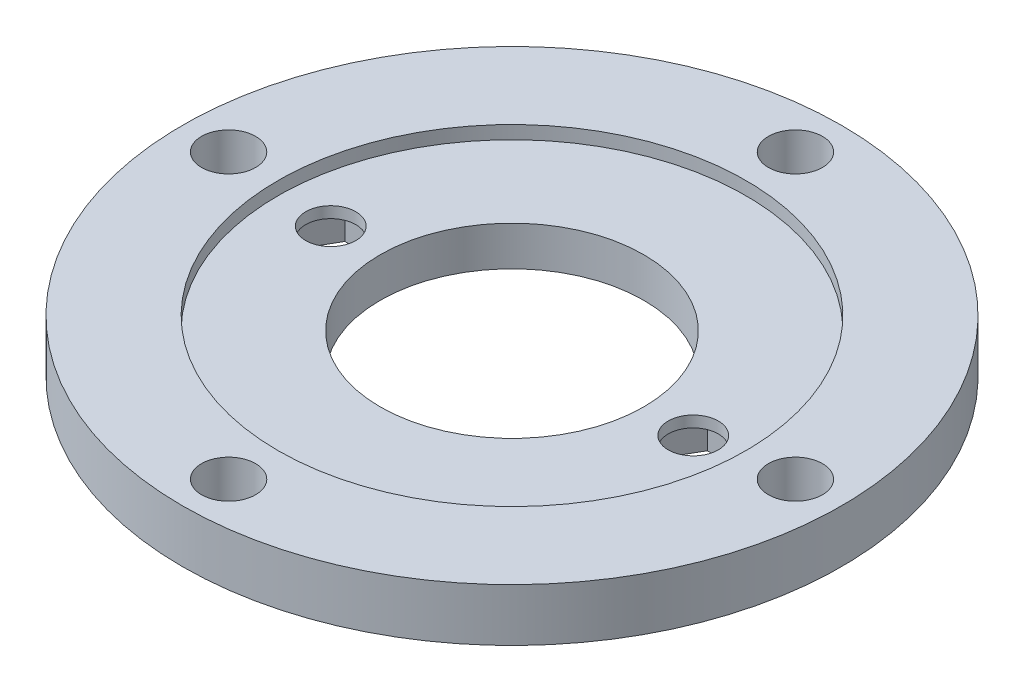
ISO-10303-21;
HEADER;
FILE_DESCRIPTION(('STEP AP214'),'2;1');
FILE_NAME('part.step','',(''),(''),'','','');
FILE_SCHEMA(('AUTOMOTIVE_DESIGN { 1 0 10303 214 1 1 1 1 }'));
ENDSEC;
DATA;
#1=APPLICATION_CONTEXT('core data for automotive mechanical design processes');
#2=APPLICATION_PROTOCOL_DEFINITION('international standard','automotive_design',2000,#1);
#3=PRODUCT_CONTEXT('',#1,'mechanical');
#4=PRODUCT('Part','Part','',(#3));
#5=PRODUCT_RELATED_PRODUCT_CATEGORY('part','',(#4));
#6=PRODUCT_DEFINITION_FORMATION('','',#4);
#7=PRODUCT_DEFINITION_CONTEXT('part definition',#1,'design');
#8=PRODUCT_DEFINITION('design','',#6,#7);
#9=PRODUCT_DEFINITION_SHAPE('','',#8);
#10=(LENGTH_UNIT() NAMED_UNIT(*) SI_UNIT(.MILLI.,.METRE.));
#11=(NAMED_UNIT(*) PLANE_ANGLE_UNIT() SI_UNIT($,.RADIAN.));
#12=(NAMED_UNIT(*) SI_UNIT($,.STERADIAN.) SOLID_ANGLE_UNIT());
#13=UNCERTAINTY_MEASURE_WITH_UNIT(LENGTH_MEASURE(1.E-05),#10,'distance_accuracy_value','');
#14=(GEOMETRIC_REPRESENTATION_CONTEXT(3) GLOBAL_UNCERTAINTY_ASSIGNED_CONTEXT((#13)) GLOBAL_UNIT_ASSIGNED_CONTEXT((#10,
#11,#12)) REPRESENTATION_CONTEXT('',''));
#15=CARTESIAN_POINT('',(0.,0.,0.));
#16=DIRECTION('',(0.,0.,1.));
#17=DIRECTION('',(1.,0.,0.));
#18=AXIS2_PLACEMENT_3D('',#15,#16,#17);
#19=CARTESIAN_POINT('',(0.,0.,0.));
#20=DIRECTION('',(0.,1.,0.));
#21=DIRECTION('',(0.,0.,1.));
#22=AXIS2_PLACEMENT_3D('',#19,#20,#21);
#23=PLANE('',#22);
#24=DIRECTION('',(0.499999999999999,0.,-0.866025403784439));
#25=VECTOR('',#24,1.);
#26=CARTESIAN_POINT('',(-16.2515717108886,0.,-9.38284930203602));
#27=LINE('',#26,#25);
#28=CARTESIAN_POINT('',(-24.5843811405924,0.,5.05));
#29=VERTEX_POINT('',#28);
#30=CARTESIAN_POINT('',(-21.6687622811848,0.,0.));
#31=VERTEX_POINT('',#30);
#32=EDGE_CURVE('E58',#29,#31,#27,.T.);
#33=ORIENTED_EDGE('',*,*,#32,.T.);
#34=DIRECTION('',(-0.5,0.,-0.866025403784439));
#35=VECTOR('',#34,1.);
#36=CARTESIAN_POINT('',(-16.2515717108886,0.,9.38284930203603));
#37=LINE('',#36,#35);
#38=CARTESIAN_POINT('',(-24.5843811405924,0.,-5.05));
#39=VERTEX_POINT('',#38);
#40=EDGE_CURVE('E149',#31,#39,#37,.T.);
#41=ORIENTED_EDGE('',*,*,#40,.T.);
#42=DIRECTION('',(-1.,0.,0.));
#43=VECTOR('',#42,1.);
#44=CARTESIAN_POINT('',(0.,0.,-5.05));
#45=LINE('',#44,#43);
#46=CARTESIAN_POINT('',(-30.4156188594076,0.,-5.05));
#47=VERTEX_POINT('',#46);
#48=EDGE_CURVE('E172',#39,#47,#45,.T.);
#49=ORIENTED_EDGE('',*,*,#48,.T.);
#50=DIRECTION('',(-0.5,0.,0.866025403784439));
#51=VECTOR('',#50,1.);
#52=CARTESIAN_POINT('',(-24.9984282891114,0.,-14.432849302036));
#53=LINE('',#52,#51);
#54=CARTESIAN_POINT('',(-33.3312377188152,0.,0.));
#55=VERTEX_POINT('',#54);
#56=EDGE_CURVE('E175',#47,#55,#53,.T.);
#57=ORIENTED_EDGE('',*,*,#56,.T.);
#58=DIRECTION('',(0.5,0.,0.866025403784439));
#59=VECTOR('',#58,1.);
#60=CARTESIAN_POINT('',(-24.9984282891114,0.,14.432849302036));
#61=LINE('',#60,#59);
#62=CARTESIAN_POINT('',(-30.4156188594076,0.,5.05));
#63=VERTEX_POINT('',#62);
#64=EDGE_CURVE('E178',#55,#63,#61,.T.);
#65=ORIENTED_EDGE('',*,*,#64,.T.);
#66=DIRECTION('',(1.,0.,0.));
#67=VECTOR('',#66,1.);
#68=CARTESIAN_POINT('',(0.,0.,5.05000000000001));
#69=LINE('',#68,#67);
#70=EDGE_CURVE('E159',#63,#29,#69,.T.);
#71=ORIENTED_EDGE('',*,*,#70,.T.);
#72=EDGE_LOOP('',(#33,#41,#49,#57,#65,#71));
#73=FACE_BOUND('',#72,.T.);
#74=CARTESIAN_POINT('',(-43.,0.,0.));
#75=DIRECTION('',(0.,1.,0.));
#76=DIRECTION('',(0.,0.,1.));
#77=AXIS2_PLACEMENT_3D('',#74,#75,#76);
#78=CIRCLE('',#77,4.1);
#79=CARTESIAN_POINT('',(-43.,0.,4.1));
#80=VERTEX_POINT('',#79);
#81=EDGE_CURVE('E201',#80,#80,#78,.T.);
#82=ORIENTED_EDGE('',*,*,#81,.T.);
#83=EDGE_LOOP('',(#82));
#84=FACE_BOUND('',#83,.T.);
#85=CARTESIAN_POINT('',(0.,0.,-43.));
#86=DIRECTION('',(0.,1.,0.));
#87=DIRECTION('',(0.,0.,1.));
#88=AXIS2_PLACEMENT_3D('',#85,#86,#87);
#89=CIRCLE('',#88,4.1);
#90=CARTESIAN_POINT('',(0.,0.,-38.9));
#91=VERTEX_POINT('',#90);
#92=EDGE_CURVE('E205',#91,#91,#89,.T.);
#93=ORIENTED_EDGE('',*,*,#92,.T.);
#94=EDGE_LOOP('',(#93));
#95=FACE_BOUND('',#94,.T.);
#96=CARTESIAN_POINT('',(43.,0.,0.));
#97=DIRECTION('',(0.,1.,0.));
#98=DIRECTION('',(0.,0.,1.));
#99=AXIS2_PLACEMENT_3D('',#96,#97,#98);
#100=CIRCLE('',#99,4.1);
#101=CARTESIAN_POINT('',(43.,0.,4.1));
#102=VERTEX_POINT('',#101);
#103=EDGE_CURVE('E198',#102,#102,#100,.T.);
#104=ORIENTED_EDGE('',*,*,#103,.T.);
#105=EDGE_LOOP('',(#104));
#106=FACE_BOUND('',#105,.T.);
#107=CARTESIAN_POINT('',(0.,0.,43.));
#108=DIRECTION('',(0.,1.,0.));
#109=DIRECTION('',(0.,0.,1.));
#110=AXIS2_PLACEMENT_3D('',#107,#108,#109);
#111=CIRCLE('',#110,4.1);
#112=CARTESIAN_POINT('',(0.,0.,47.1));
#113=VERTEX_POINT('',#112);
#114=EDGE_CURVE('E218',#113,#113,#111,.T.);
#115=ORIENTED_EDGE('',*,*,#114,.T.);
#116=EDGE_LOOP('',(#115));
#117=FACE_BOUND('',#116,.T.);
#118=CARTESIAN_POINT('',(0.,0.,0.));
#119=DIRECTION('',(0.,1.,0.));
#120=DIRECTION('',(0.,0.,1.));
#121=AXIS2_PLACEMENT_3D('',#118,#119,#120);
#122=CIRCLE('',#121,50.);
#123=CARTESIAN_POINT('',(0.,0.,50.));
#124=VERTEX_POINT('',#123);
#125=EDGE_CURVE('E227',#124,#124,#122,.T.);
#126=ORIENTED_EDGE('',*,*,#125,.F.);
#127=EDGE_LOOP('',(#126));
#128=FACE_BOUND('',#127,.T.);
#129=CARTESIAN_POINT('',(0.,0.,0.));
#130=DIRECTION('',(0.,1.,0.));
#131=DIRECTION('',(0.,0.,1.));
#132=AXIS2_PLACEMENT_3D('',#129,#130,#131);
#133=CIRCLE('',#132,20.);
#134=CARTESIAN_POINT('',(0.,0.,20.));
#135=VERTEX_POINT('',#134);
#136=EDGE_CURVE('E194',#135,#135,#133,.T.);
#137=ORIENTED_EDGE('',*,*,#136,.T.);
#138=EDGE_LOOP('',(#137));
#139=FACE_BOUND('',#138,.T.);
#140=DIRECTION('',(0.499999999999999,0.,-0.866025403784439));
#141=VECTOR('',#140,1.);
#142=CARTESIAN_POINT('',(24.9984282891114,0.,14.432849302036));
#143=LINE('',#142,#141);
#144=CARTESIAN_POINT('',(30.4156188594076,0.,5.05));
#145=VERTEX_POINT('',#144);
#146=CARTESIAN_POINT('',(33.3312377188152,0.,0.));
#147=VERTEX_POINT('',#146);
#148=EDGE_CURVE('E50',#145,#147,#143,.T.);
#149=ORIENTED_EDGE('',*,*,#148,.T.);
#150=DIRECTION('',(-0.5,0.,-0.866025403784439));
#151=VECTOR('',#150,1.);
#152=CARTESIAN_POINT('',(24.9984282891114,0.,-14.432849302036));
#153=LINE('',#152,#151);
#154=CARTESIAN_POINT('',(30.4156188594076,0.,-5.05000000000001));
#155=VERTEX_POINT('',#154);
#156=EDGE_CURVE('E146',#147,#155,#153,.T.);
#157=ORIENTED_EDGE('',*,*,#156,.T.);
#158=DIRECTION('',(-1.,0.,0.));
#159=VECTOR('',#158,1.);
#160=CARTESIAN_POINT('',(0.,0.,-5.05000000000001));
#161=LINE('',#160,#159);
#162=CARTESIAN_POINT('',(24.5843811405924,0.,-5.05000000000001));
#163=VERTEX_POINT('',#162);
#164=EDGE_CURVE('E254',#155,#163,#161,.T.);
#165=ORIENTED_EDGE('',*,*,#164,.T.);
#166=DIRECTION('',(-0.5,0.,0.866025403784439));
#167=VECTOR('',#166,1.);
#168=CARTESIAN_POINT('',(16.2515717108886,0.,9.38284930203603));
#169=LINE('',#168,#167);
#170=CARTESIAN_POINT('',(21.6687622811848,0.,0.));
#171=VERTEX_POINT('',#170);
#172=EDGE_CURVE('E257',#163,#171,#169,.T.);
#173=ORIENTED_EDGE('',*,*,#172,.T.);
#174=DIRECTION('',(0.5,0.,0.866025403784439));
#175=VECTOR('',#174,1.);
#176=CARTESIAN_POINT('',(16.2515717108886,0.,-9.38284930203603));
#177=LINE('',#176,#175);
#178=CARTESIAN_POINT('',(24.5843811405924,0.,5.05));
#179=VERTEX_POINT('',#178);
#180=EDGE_CURVE('E260',#171,#179,#177,.T.);
#181=ORIENTED_EDGE('',*,*,#180,.T.);
#182=DIRECTION('',(1.,0.,0.));
#183=VECTOR('',#182,1.);
#184=CARTESIAN_POINT('',(0.,0.,5.05));
#185=LINE('',#184,#183);
#186=EDGE_CURVE('E142',#179,#145,#185,.T.);
#187=ORIENTED_EDGE('',*,*,#186,.T.);
#188=EDGE_LOOP('',(#149,#157,#165,#173,#181,#187));
#189=FACE_BOUND('',#188,.T.);
#190=ADVANCED_FACE('F33',(#73,#84,#95,#106,#117,#128,#139,#189),#23,.F.);
#191=CARTESIAN_POINT('',(0.,8.,0.));
#192=DIRECTION('',(0.,1.,0.));
#193=DIRECTION('',(0.,0.,1.));
#194=AXIS2_PLACEMENT_3D('',#191,#192,#193);
#195=PLANE('',#194);
#196=CARTESIAN_POINT('',(-43.,8.,0.));
#197=DIRECTION('',(0.,1.,0.));
#198=DIRECTION('',(0.,0.,1.));
#199=AXIS2_PLACEMENT_3D('',#196,#197,#198);
#200=CIRCLE('',#199,4.1);
#201=CARTESIAN_POINT('',(-43.,8.,4.1));
#202=VERTEX_POINT('',#201);
#203=EDGE_CURVE('E215',#202,#202,#200,.T.);
#204=ORIENTED_EDGE('',*,*,#203,.F.);
#205=EDGE_LOOP('',(#204));
#206=FACE_BOUND('',#205,.T.);
#207=CARTESIAN_POINT('',(0.,8.,-43.));
#208=DIRECTION('',(0.,1.,0.));
#209=DIRECTION('',(0.,0.,1.));
#210=AXIS2_PLACEMENT_3D('',#207,#208,#209);
#211=CIRCLE('',#210,4.1);
#212=CARTESIAN_POINT('',(0.,8.,-38.9));
#213=VERTEX_POINT('',#212);
#214=EDGE_CURVE('E212',#213,#213,#211,.T.);
#215=ORIENTED_EDGE('',*,*,#214,.F.);
#216=EDGE_LOOP('',(#215));
#217=FACE_BOUND('',#216,.T.);
#218=CARTESIAN_POINT('',(43.,8.,0.));
#219=DIRECTION('',(0.,1.,0.));
#220=DIRECTION('',(0.,0.,1.));
#221=AXIS2_PLACEMENT_3D('',#218,#219,#220);
#222=CIRCLE('',#221,4.1);
#223=CARTESIAN_POINT('',(43.,8.,4.1));
#224=VERTEX_POINT('',#223);
#225=EDGE_CURVE('E204',#224,#224,#222,.T.);
#226=ORIENTED_EDGE('',*,*,#225,.F.);
#227=EDGE_LOOP('',(#226));
#228=FACE_BOUND('',#227,.T.);
#229=CARTESIAN_POINT('',(0.,8.,43.));
#230=DIRECTION('',(0.,1.,0.));
#231=DIRECTION('',(0.,0.,1.));
#232=AXIS2_PLACEMENT_3D('',#229,#230,#231);
#233=CIRCLE('',#232,4.1);
#234=CARTESIAN_POINT('',(0.,8.,47.1));
#235=VERTEX_POINT('',#234);
#236=EDGE_CURVE('E221',#235,#235,#233,.T.);
#237=ORIENTED_EDGE('',*,*,#236,.F.);
#238=EDGE_LOOP('',(#237));
#239=FACE_BOUND('',#238,.T.);
#240=CARTESIAN_POINT('',(0.,8.,0.));
#241=DIRECTION('',(0.,1.,0.));
#242=DIRECTION('',(0.,0.,1.));
#243=AXIS2_PLACEMENT_3D('',#240,#241,#242);
#244=CIRCLE('',#243,50.);
#245=CARTESIAN_POINT('',(0.,8.,50.));
#246=VERTEX_POINT('',#245);
#247=EDGE_CURVE('E42',#246,#246,#244,.T.);
#248=ORIENTED_EDGE('',*,*,#247,.T.);
#249=EDGE_LOOP('',(#248));
#250=FACE_BOUND('',#249,.T.);
#251=CARTESIAN_POINT('',(0.,8.,0.));
#252=DIRECTION('',(0.,1.,0.));
#253=DIRECTION('',(0.,0.,1.));
#254=AXIS2_PLACEMENT_3D('',#251,#252,#253);
#255=CIRCLE('',#254,35.5);
#256=CARTESIAN_POINT('',(0.,8.,35.5));
#257=VERTEX_POINT('',#256);
#258=EDGE_CURVE('E224',#257,#257,#255,.T.);
#259=ORIENTED_EDGE('',*,*,#258,.F.);
#260=EDGE_LOOP('',(#259));
#261=FACE_BOUND('',#260,.T.);
#262=ADVANCED_FACE('F295',(#206,#217,#228,#239,#250,#261),#195,.T.);
#263=CARTESIAN_POINT('',(0.,8.,0.));
#264=DIRECTION('',(0.,-1.,0.));
#265=DIRECTION('',(0.,0.,-1.));
#266=AXIS2_PLACEMENT_3D('',#263,#264,#265);
#267=CYLINDRICAL_SURFACE('',#266,50.);
#268=ORIENTED_EDGE('',*,*,#247,.F.);
#269=EDGE_LOOP('',(#268));
#270=FACE_BOUND('',#269,.T.);
#271=ORIENTED_EDGE('',*,*,#125,.T.);
#272=EDGE_LOOP('',(#271));
#273=FACE_BOUND('',#272,.T.);
#274=ADVANCED_FACE('F35',(#270,#273),#267,.T.);
#275=CARTESIAN_POINT('',(0.,8.,0.));
#276=DIRECTION('',(0.,-1.,0.));
#277=DIRECTION('',(0.,0.,-1.));
#278=AXIS2_PLACEMENT_3D('',#275,#276,#277);
#279=CYLINDRICAL_SURFACE('',#278,35.5);
#280=CARTESIAN_POINT('',(0.,6.,0.));
#281=DIRECTION('',(0.,1.,0.));
#282=DIRECTION('',(0.,0.,1.));
#283=AXIS2_PLACEMENT_3D('',#280,#281,#282);
#284=CIRCLE('',#283,35.5);
#285=CARTESIAN_POINT('',(0.,6.,35.5));
#286=VERTEX_POINT('',#285);
#287=EDGE_CURVE('E11',#286,#286,#284,.T.);
#288=ORIENTED_EDGE('',*,*,#287,.F.);
#289=EDGE_LOOP('',(#288));
#290=FACE_BOUND('',#289,.T.);
#291=ORIENTED_EDGE('',*,*,#258,.T.);
#292=EDGE_LOOP('',(#291));
#293=FACE_BOUND('',#292,.T.);
#294=ADVANCED_FACE('F304',(#290,#293),#279,.F.);
#295=CARTESIAN_POINT('',(0.,0.,43.));
#296=DIRECTION('',(0.,1.,0.));
#297=DIRECTION('',(0.,0.,1.));
#298=AXIS2_PLACEMENT_3D('',#295,#296,#297);
#299=CYLINDRICAL_SURFACE('',#298,4.1);
#300=ORIENTED_EDGE('',*,*,#236,.T.);
#301=EDGE_LOOP('',(#300));
#302=FACE_BOUND('',#301,.T.);
#303=ORIENTED_EDGE('',*,*,#114,.F.);
#304=EDGE_LOOP('',(#303));
#305=FACE_BOUND('',#304,.T.);
#306=ADVANCED_FACE('F307',(#302,#305),#299,.F.);
#307=CARTESIAN_POINT('',(43.,0.,0.));
#308=DIRECTION('',(0.,1.,0.));
#309=DIRECTION('',(0.,0.,1.));
#310=AXIS2_PLACEMENT_3D('',#307,#308,#309);
#311=CYLINDRICAL_SURFACE('',#310,4.1);
#312=ORIENTED_EDGE('',*,*,#225,.T.);
#313=EDGE_LOOP('',(#312));
#314=FACE_BOUND('',#313,.T.);
#315=ORIENTED_EDGE('',*,*,#103,.F.);
#316=EDGE_LOOP('',(#315));
#317=FACE_BOUND('',#316,.T.);
#318=ADVANCED_FACE('F311',(#314,#317),#311,.F.);
#319=CARTESIAN_POINT('',(0.,0.,-43.));
#320=DIRECTION('',(0.,1.,0.));
#321=DIRECTION('',(0.,0.,1.));
#322=AXIS2_PLACEMENT_3D('',#319,#320,#321);
#323=CYLINDRICAL_SURFACE('',#322,4.1);
#324=ORIENTED_EDGE('',*,*,#214,.T.);
#325=EDGE_LOOP('',(#324));
#326=FACE_BOUND('',#325,.T.);
#327=ORIENTED_EDGE('',*,*,#92,.F.);
#328=EDGE_LOOP('',(#327));
#329=FACE_BOUND('',#328,.T.);
#330=ADVANCED_FACE('F315',(#326,#329),#323,.F.);
#331=CARTESIAN_POINT('',(-43.,0.,0.));
#332=DIRECTION('',(0.,1.,0.));
#333=DIRECTION('',(0.,0.,1.));
#334=AXIS2_PLACEMENT_3D('',#331,#332,#333);
#335=CYLINDRICAL_SURFACE('',#334,4.1);
#336=ORIENTED_EDGE('',*,*,#203,.T.);
#337=EDGE_LOOP('',(#336));
#338=FACE_BOUND('',#337,.T.);
#339=ORIENTED_EDGE('',*,*,#81,.F.);
#340=EDGE_LOOP('',(#339));
#341=FACE_BOUND('',#340,.T.);
#342=ADVANCED_FACE('F319',(#338,#341),#335,.F.);
#343=CARTESIAN_POINT('',(0.,6.,0.));
#344=DIRECTION('',(0.,1.,0.));
#345=DIRECTION('',(0.,0.,1.));
#346=AXIS2_PLACEMENT_3D('',#343,#344,#345);
#347=PLANE('',#346);
#348=CARTESIAN_POINT('',(27.5,6.,0.));
#349=DIRECTION('',(0.,1.,0.));
#350=DIRECTION('',(0.,0.,1.));
#351=AXIS2_PLACEMENT_3D('',#348,#349,#350);
#352=CIRCLE('',#351,3.8);
#353=CARTESIAN_POINT('',(27.5,6.,3.8));
#354=VERTEX_POINT('',#353);
#355=EDGE_CURVE('E234',#354,#354,#352,.T.);
#356=ORIENTED_EDGE('',*,*,#355,.F.);
#357=EDGE_LOOP('',(#356));
#358=FACE_BOUND('',#357,.T.);
#359=CARTESIAN_POINT('',(-27.5,6.,0.));
#360=DIRECTION('',(0.,1.,0.));
#361=DIRECTION('',(0.,0.,1.));
#362=AXIS2_PLACEMENT_3D('',#359,#360,#361);
#363=CIRCLE('',#362,3.8);
#364=CARTESIAN_POINT('',(-27.5,6.,3.8));
#365=VERTEX_POINT('',#364);
#366=EDGE_CURVE('E233',#365,#365,#363,.T.);
#367=ORIENTED_EDGE('',*,*,#366,.F.);
#368=EDGE_LOOP('',(#367));
#369=FACE_BOUND('',#368,.T.);
#370=ORIENTED_EDGE('',*,*,#287,.T.);
#371=EDGE_LOOP('',(#370));
#372=FACE_BOUND('',#371,.T.);
#373=CARTESIAN_POINT('',(0.,6.,0.));
#374=DIRECTION('',(0.,1.,0.));
#375=DIRECTION('',(0.,0.,1.));
#376=AXIS2_PLACEMENT_3D('',#373,#374,#375);
#377=CIRCLE('',#376,20.);
#378=CARTESIAN_POINT('',(0.,6.,20.));
#379=VERTEX_POINT('',#378);
#380=EDGE_CURVE('E195',#379,#379,#377,.T.);
#381=ORIENTED_EDGE('',*,*,#380,.F.);
#382=EDGE_LOOP('',(#381));
#383=FACE_BOUND('',#382,.T.);
#384=ADVANCED_FACE('F323',(#358,#369,#372,#383),#347,.T.);
#385=CARTESIAN_POINT('',(0.,6.,0.));
#386=DIRECTION('',(0.,-1.,0.));
#387=DIRECTION('',(0.,0.,-1.));
#388=AXIS2_PLACEMENT_3D('',#385,#386,#387);
#389=CYLINDRICAL_SURFACE('',#388,20.);
#390=ORIENTED_EDGE('',*,*,#380,.T.);
#391=EDGE_LOOP('',(#390));
#392=FACE_BOUND('',#391,.T.);
#393=ORIENTED_EDGE('',*,*,#136,.F.);
#394=EDGE_LOOP('',(#393));
#395=FACE_BOUND('',#394,.T.);
#396=ADVANCED_FACE('F327',(#392,#395),#389,.F.);
#397=CARTESIAN_POINT('',(-16.2515717108886,4.3,-9.38284930203602));
#398=DIRECTION('',(-0.866025403784439,0.,-0.499999999999999));
#399=DIRECTION('',(-0.499999999999999,0.,0.866025403784439));
#400=AXIS2_PLACEMENT_3D('',#397,#398,#399);
#401=PLANE('',#400);
#402=ORIENTED_EDGE('',*,*,#32,.F.);
#403=DIRECTION('',(0.,-1.,0.));
#404=VECTOR('',#403,1.);
#405=CARTESIAN_POINT('',(-24.5843811405924,4.3,5.05));
#406=LINE('',#405,#404);
#407=CARTESIAN_POINT('',(-24.5843811405924,4.3,5.05));
#408=VERTEX_POINT('',#407);
#409=EDGE_CURVE('E168',#408,#29,#406,.T.);
#410=ORIENTED_EDGE('',*,*,#409,.F.);
#411=DIRECTION('',(0.499999999999999,0.,-0.866025403784439));
#412=VECTOR('',#411,1.);
#413=CARTESIAN_POINT('',(-16.2515717108886,4.3,-9.38284930203602));
#414=LINE('',#413,#412);
#415=CARTESIAN_POINT('',(-21.6687622811848,4.3,0.));
#416=VERTEX_POINT('',#415);
#417=EDGE_CURVE('E155',#408,#416,#414,.T.);
#418=ORIENTED_EDGE('',*,*,#417,.T.);
#419=DIRECTION('',(0.,-1.,0.));
#420=VECTOR('',#419,1.);
#421=CARTESIAN_POINT('',(-21.6687622811848,4.3,0.));
#422=LINE('',#421,#420);
#423=EDGE_CURVE('E192',#416,#31,#422,.T.);
#424=ORIENTED_EDGE('',*,*,#423,.T.);
#425=EDGE_LOOP('',(#402,#410,#418,#424));
#426=FACE_BOUND('',#425,.T.);
#427=ADVANCED_FACE('F331',(#426),#401,.T.);
#428=CARTESIAN_POINT('',(-16.2515717108886,4.3,9.38284930203603));
#429=DIRECTION('',(-0.866025403784439,0.,0.5));
#430=DIRECTION('',(0.5,0.,0.866025403784439));
#431=AXIS2_PLACEMENT_3D('',#428,#429,#430);
#432=PLANE('',#431);
#433=ORIENTED_EDGE('',*,*,#40,.F.);
#434=ORIENTED_EDGE('',*,*,#423,.F.);
#435=DIRECTION('',(-0.5,0.,-0.866025403784439));
#436=VECTOR('',#435,1.);
#437=CARTESIAN_POINT('',(-16.2515717108886,4.3,9.38284930203603));
#438=LINE('',#437,#436);
#439=CARTESIAN_POINT('',(-24.5843811405924,4.3,-5.05));
#440=VERTEX_POINT('',#439);
#441=EDGE_CURVE('E158',#416,#440,#438,.T.);
#442=ORIENTED_EDGE('',*,*,#441,.T.);
#443=DIRECTION('',(0.,-1.,0.));
#444=VECTOR('',#443,1.);
#445=CARTESIAN_POINT('',(-24.5843811405924,4.3,-5.05));
#446=LINE('',#445,#444);
#447=EDGE_CURVE('E190',#440,#39,#446,.T.);
#448=ORIENTED_EDGE('',*,*,#447,.T.);
#449=EDGE_LOOP('',(#433,#434,#442,#448));
#450=FACE_BOUND('',#449,.T.);
#451=ADVANCED_FACE('F335',(#450),#432,.T.);
#452=CARTESIAN_POINT('',(0.,4.3,-5.05));
#453=DIRECTION('',(0.,0.,1.));
#454=DIRECTION('',(1.,0.,0.));
#455=AXIS2_PLACEMENT_3D('',#452,#453,#454);
#456=PLANE('',#455);
#457=ORIENTED_EDGE('',*,*,#48,.F.);
#458=ORIENTED_EDGE('',*,*,#447,.F.);
#459=DIRECTION('',(-1.,0.,0.));
#460=VECTOR('',#459,1.);
#461=CARTESIAN_POINT('',(0.,4.3,-5.05));
#462=LINE('',#461,#460);
#463=CARTESIAN_POINT('',(-30.4156188594076,4.3,-5.05));
#464=VERTEX_POINT('',#463);
#465=EDGE_CURVE('E161',#440,#464,#462,.T.);
#466=ORIENTED_EDGE('',*,*,#465,.T.);
#467=DIRECTION('',(0.,-1.,0.));
#468=VECTOR('',#467,1.);
#469=CARTESIAN_POINT('',(-30.4156188594076,4.3,-5.05));
#470=LINE('',#469,#468);
#471=EDGE_CURVE('E188',#464,#47,#470,.T.);
#472=ORIENTED_EDGE('',*,*,#471,.T.);
#473=EDGE_LOOP('',(#457,#458,#466,#472));
#474=FACE_BOUND('',#473,.T.);
#475=ADVANCED_FACE('F338',(#474),#456,.T.);
#476=CARTESIAN_POINT('',(-24.9984282891114,4.3,-14.432849302036));
#477=DIRECTION('',(0.866025403784439,0.,0.5));
#478=DIRECTION('',(0.5,0.,-0.866025403784439));
#479=AXIS2_PLACEMENT_3D('',#476,#477,#478);
#480=PLANE('',#479);
#481=ORIENTED_EDGE('',*,*,#56,.F.);
#482=ORIENTED_EDGE('',*,*,#471,.F.);
#483=DIRECTION('',(-0.5,0.,0.866025403784439));
#484=VECTOR('',#483,1.);
#485=CARTESIAN_POINT('',(-24.9984282891114,4.3,-14.432849302036));
#486=LINE('',#485,#484);
#487=CARTESIAN_POINT('',(-33.3312377188152,4.3,0.));
#488=VERTEX_POINT('',#487);
#489=EDGE_CURVE('E163',#464,#488,#486,.T.);
#490=ORIENTED_EDGE('',*,*,#489,.T.);
#491=DIRECTION('',(0.,-1.,0.));
#492=VECTOR('',#491,1.);
#493=CARTESIAN_POINT('',(-33.3312377188152,4.3,0.));
#494=LINE('',#493,#492);
#495=EDGE_CURVE('E186',#488,#55,#494,.T.);
#496=ORIENTED_EDGE('',*,*,#495,.T.);
#497=EDGE_LOOP('',(#481,#482,#490,#496));
#498=FACE_BOUND('',#497,.T.);
#499=ADVANCED_FACE('F342',(#498),#480,.T.);
#500=CARTESIAN_POINT('',(-24.9984282891114,4.3,14.432849302036));
#501=DIRECTION('',(0.866025403784438,0.,-0.5));
#502=DIRECTION('',(-0.5,0.,-0.866025403784439));
#503=AXIS2_PLACEMENT_3D('',#500,#501,#502);
#504=PLANE('',#503);
#505=ORIENTED_EDGE('',*,*,#64,.F.);
#506=ORIENTED_EDGE('',*,*,#495,.F.);
#507=DIRECTION('',(0.5,0.,0.866025403784439));
#508=VECTOR('',#507,1.);
#509=CARTESIAN_POINT('',(-24.9984282891114,4.3,14.432849302036));
#510=LINE('',#509,#508);
#511=CARTESIAN_POINT('',(-30.4156188594076,4.3,5.05));
#512=VERTEX_POINT('',#511);
#513=EDGE_CURVE('E165',#488,#512,#510,.T.);
#514=ORIENTED_EDGE('',*,*,#513,.T.);
#515=DIRECTION('',(0.,-1.,0.));
#516=VECTOR('',#515,1.);
#517=CARTESIAN_POINT('',(-30.4156188594076,4.3,5.05));
#518=LINE('',#517,#516);
#519=EDGE_CURVE('E184',#512,#63,#518,.T.);
#520=ORIENTED_EDGE('',*,*,#519,.T.);
#521=EDGE_LOOP('',(#505,#506,#514,#520));
#522=FACE_BOUND('',#521,.T.);
#523=ADVANCED_FACE('F346',(#522),#504,.T.);
#524=CARTESIAN_POINT('',(0.,4.3,5.05000000000001));
#525=DIRECTION('',(0.,0.,-1.));
#526=DIRECTION('',(-1.,0.,0.));
#527=AXIS2_PLACEMENT_3D('',#524,#525,#526);
#528=PLANE('',#527);
#529=ORIENTED_EDGE('',*,*,#70,.F.);
#530=ORIENTED_EDGE('',*,*,#519,.F.);
#531=DIRECTION('',(1.,0.,0.));
#532=VECTOR('',#531,1.);
#533=CARTESIAN_POINT('',(0.,4.3,5.05000000000001));
#534=LINE('',#533,#532);
#535=EDGE_CURVE('E167',#512,#408,#534,.T.);
#536=ORIENTED_EDGE('',*,*,#535,.T.);
#537=ORIENTED_EDGE('',*,*,#409,.T.);
#538=EDGE_LOOP('',(#529,#530,#536,#537));
#539=FACE_BOUND('',#538,.T.);
#540=ADVANCED_FACE('F350',(#539),#528,.T.);
#541=CARTESIAN_POINT('',(0.,4.3,0.));
#542=DIRECTION('',(0.,1.,0.));
#543=DIRECTION('',(0.,0.,1.));
#544=AXIS2_PLACEMENT_3D('',#541,#542,#543);
#545=PLANE('',#544);
#546=CARTESIAN_POINT('',(-27.5,4.3,0.));
#547=DIRECTION('',(0.,1.,0.));
#548=DIRECTION('',(0.,0.,1.));
#549=AXIS2_PLACEMENT_3D('',#546,#547,#548);
#550=CIRCLE('',#549,3.8);
#551=CARTESIAN_POINT('',(-27.5,4.3,3.8));
#552=VERTEX_POINT('',#551);
#553=EDGE_CURVE('E231',#552,#552,#550,.T.);
#554=ORIENTED_EDGE('',*,*,#553,.T.);
#555=EDGE_LOOP('',(#554));
#556=FACE_BOUND('',#555,.T.);
#557=ORIENTED_EDGE('',*,*,#417,.F.);
#558=ORIENTED_EDGE('',*,*,#535,.F.);
#559=ORIENTED_EDGE('',*,*,#513,.F.);
#560=ORIENTED_EDGE('',*,*,#489,.F.);
#561=ORIENTED_EDGE('',*,*,#465,.F.);
#562=ORIENTED_EDGE('',*,*,#441,.F.);
#563=EDGE_LOOP('',(#557,#558,#559,#560,#561,#562));
#564=FACE_BOUND('',#563,.T.);
#565=ADVANCED_FACE('F354',(#556,#564),#545,.F.);
#566=CARTESIAN_POINT('',(24.9984282891114,4.3,14.432849302036));
#567=DIRECTION('',(-0.866025403784439,0.,-0.499999999999999));
#568=DIRECTION('',(-0.499999999999999,0.,0.866025403784439));
#569=AXIS2_PLACEMENT_3D('',#566,#567,#568);
#570=PLANE('',#569);
#571=ORIENTED_EDGE('',*,*,#148,.F.);
#572=DIRECTION('',(0.,-1.,0.));
#573=VECTOR('',#572,1.);
#574=CARTESIAN_POINT('',(30.4156188594076,4.3,5.05));
#575=LINE('',#574,#573);
#576=CARTESIAN_POINT('',(30.4156188594076,4.3,5.05));
#577=VERTEX_POINT('',#576);
#578=EDGE_CURVE('E141',#577,#145,#575,.T.);
#579=ORIENTED_EDGE('',*,*,#578,.F.);
#580=DIRECTION('',(0.499999999999999,0.,-0.866025403784439));
#581=VECTOR('',#580,1.);
#582=CARTESIAN_POINT('',(24.9984282891114,4.3,14.432849302036));
#583=LINE('',#582,#581);
#584=CARTESIAN_POINT('',(33.3312377188152,4.3,0.));
#585=VERTEX_POINT('',#584);
#586=EDGE_CURVE('E132',#577,#585,#583,.T.);
#587=ORIENTED_EDGE('',*,*,#586,.T.);
#588=DIRECTION('',(0.,-1.,0.));
#589=VECTOR('',#588,1.);
#590=CARTESIAN_POINT('',(33.3312377188152,4.3,0.));
#591=LINE('',#590,#589);
#592=EDGE_CURVE('E140',#585,#147,#591,.T.);
#593=ORIENTED_EDGE('',*,*,#592,.T.);
#594=EDGE_LOOP('',(#571,#579,#587,#593));
#595=FACE_BOUND('',#594,.T.);
#596=ADVANCED_FACE('F139',(#595),#570,.T.);
#597=CARTESIAN_POINT('',(24.9984282891114,4.3,-14.432849302036));
#598=DIRECTION('',(-0.866025403784439,0.,0.5));
#599=DIRECTION('',(0.5,0.,0.866025403784439));
#600=AXIS2_PLACEMENT_3D('',#597,#598,#599);
#601=PLANE('',#600);
#602=ORIENTED_EDGE('',*,*,#156,.F.);
#603=ORIENTED_EDGE('',*,*,#592,.F.);
#604=DIRECTION('',(-0.5,0.,-0.866025403784439));
#605=VECTOR('',#604,1.);
#606=CARTESIAN_POINT('',(24.9984282891114,4.3,-14.432849302036));
#607=LINE('',#606,#605);
#608=CARTESIAN_POINT('',(30.4156188594076,4.3,-5.05000000000001));
#609=VERTEX_POINT('',#608);
#610=EDGE_CURVE('E128',#585,#609,#607,.T.);
#611=ORIENTED_EDGE('',*,*,#610,.T.);
#612=DIRECTION('',(0.,-1.,0.));
#613=VECTOR('',#612,1.);
#614=CARTESIAN_POINT('',(30.4156188594076,4.3,-5.05000000000001));
#615=LINE('',#614,#613);
#616=EDGE_CURVE('E147',#609,#155,#615,.T.);
#617=ORIENTED_EDGE('',*,*,#616,.T.);
#618=EDGE_LOOP('',(#602,#603,#611,#617));
#619=FACE_BOUND('',#618,.T.);
#620=ADVANCED_FACE('F144',(#619),#601,.T.);
#621=CARTESIAN_POINT('',(0.,4.3,-5.05000000000001));
#622=DIRECTION('',(0.,0.,1.));
#623=DIRECTION('',(1.,0.,0.));
#624=AXIS2_PLACEMENT_3D('',#621,#622,#623);
#625=PLANE('',#624);
#626=ORIENTED_EDGE('',*,*,#164,.F.);
#627=ORIENTED_EDGE('',*,*,#616,.F.);
#628=DIRECTION('',(-1.,0.,0.));
#629=VECTOR('',#628,1.);
#630=CARTESIAN_POINT('',(0.,4.3,-5.05000000000001));
#631=LINE('',#630,#629);
#632=CARTESIAN_POINT('',(24.5843811405924,4.3,-5.05000000000001));
#633=VERTEX_POINT('',#632);
#634=EDGE_CURVE('E134',#609,#633,#631,.T.);
#635=ORIENTED_EDGE('',*,*,#634,.T.);
#636=DIRECTION('',(0.,-1.,0.));
#637=VECTOR('',#636,1.);
#638=CARTESIAN_POINT('',(24.5843811405924,4.3,-5.05000000000001));
#639=LINE('',#638,#637);
#640=EDGE_CURVE('E151',#633,#163,#639,.T.);
#641=ORIENTED_EDGE('',*,*,#640,.T.);
#642=EDGE_LOOP('',(#626,#627,#635,#641));
#643=FACE_BOUND('',#642,.T.);
#644=ADVANCED_FACE('F273',(#643),#625,.T.);
#645=CARTESIAN_POINT('',(16.2515717108886,4.3,9.38284930203603));
#646=DIRECTION('',(0.866025403784439,0.,0.5));
#647=DIRECTION('',(0.5,0.,-0.866025403784439));
#648=AXIS2_PLACEMENT_3D('',#645,#646,#647);
#649=PLANE('',#648);
#650=ORIENTED_EDGE('',*,*,#172,.F.);
#651=ORIENTED_EDGE('',*,*,#640,.F.);
#652=DIRECTION('',(-0.5,0.,0.866025403784439));
#653=VECTOR('',#652,1.);
#654=CARTESIAN_POINT('',(16.2515717108886,4.3,9.38284930203603));
#655=LINE('',#654,#653);
#656=CARTESIAN_POINT('',(21.6687622811848,4.3,0.));
#657=VERTEX_POINT('',#656);
#658=EDGE_CURVE('E246',#633,#657,#655,.T.);
#659=ORIENTED_EDGE('',*,*,#658,.T.);
#660=DIRECTION('',(0.,-1.,0.));
#661=VECTOR('',#660,1.);
#662=CARTESIAN_POINT('',(21.6687622811848,4.3,0.));
#663=LINE('',#662,#661);
#664=EDGE_CURVE('E268',#657,#171,#663,.T.);
#665=ORIENTED_EDGE('',*,*,#664,.T.);
#666=EDGE_LOOP('',(#650,#651,#659,#665));
#667=FACE_BOUND('',#666,.T.);
#668=ADVANCED_FACE('F275',(#667),#649,.T.);
#669=CARTESIAN_POINT('',(16.2515717108886,4.3,-9.38284930203603));
#670=DIRECTION('',(0.866025403784439,0.,-0.5));
#671=DIRECTION('',(-0.5,0.,-0.866025403784439));
#672=AXIS2_PLACEMENT_3D('',#669,#670,#671);
#673=PLANE('',#672);
#674=ORIENTED_EDGE('',*,*,#180,.F.);
#675=ORIENTED_EDGE('',*,*,#664,.F.);
#676=DIRECTION('',(0.5,0.,0.866025403784439));
#677=VECTOR('',#676,1.);
#678=CARTESIAN_POINT('',(16.2515717108886,4.3,-9.38284930203603));
#679=LINE('',#678,#677);
#680=CARTESIAN_POINT('',(24.5843811405924,4.3,5.05));
#681=VERTEX_POINT('',#680);
#682=EDGE_CURVE('E248',#657,#681,#679,.T.);
#683=ORIENTED_EDGE('',*,*,#682,.T.);
#684=DIRECTION('',(0.,-1.,0.));
#685=VECTOR('',#684,1.);
#686=CARTESIAN_POINT('',(24.5843811405924,4.3,5.05));
#687=LINE('',#686,#685);
#688=EDGE_CURVE('E266',#681,#179,#687,.T.);
#689=ORIENTED_EDGE('',*,*,#688,.T.);
#690=EDGE_LOOP('',(#674,#675,#683,#689));
#691=FACE_BOUND('',#690,.T.);
#692=ADVANCED_FACE('F285',(#691),#673,.T.);
#693=CARTESIAN_POINT('',(0.,4.3,5.05));
#694=DIRECTION('',(0.,0.,-1.));
#695=DIRECTION('',(-1.,0.,0.));
#696=AXIS2_PLACEMENT_3D('',#693,#694,#695);
#697=PLANE('',#696);
#698=ORIENTED_EDGE('',*,*,#186,.F.);
#699=ORIENTED_EDGE('',*,*,#688,.F.);
#700=DIRECTION('',(1.,0.,0.));
#701=VECTOR('',#700,1.);
#702=CARTESIAN_POINT('',(0.,4.3,5.05));
#703=LINE('',#702,#701);
#704=EDGE_CURVE('E250',#681,#577,#703,.T.);
#705=ORIENTED_EDGE('',*,*,#704,.T.);
#706=ORIENTED_EDGE('',*,*,#578,.T.);
#707=EDGE_LOOP('',(#698,#699,#705,#706));
#708=FACE_BOUND('',#707,.T.);
#709=ADVANCED_FACE('F282',(#708),#697,.T.);
#710=CARTESIAN_POINT('',(0.,4.3,0.));
#711=DIRECTION('',(0.,1.,0.));
#712=DIRECTION('',(0.,0.,1.));
#713=AXIS2_PLACEMENT_3D('',#710,#711,#712);
#714=PLANE('',#713);
#715=CARTESIAN_POINT('',(27.5,4.3,0.));
#716=DIRECTION('',(0.,1.,0.));
#717=DIRECTION('',(0.,0.,1.));
#718=AXIS2_PLACEMENT_3D('',#715,#716,#717);
#719=CIRCLE('',#718,3.8);
#720=CARTESIAN_POINT('',(27.5,4.3,3.8));
#721=VERTEX_POINT('',#720);
#722=EDGE_CURVE('E37',#721,#721,#719,.T.);
#723=ORIENTED_EDGE('',*,*,#722,.T.);
#724=EDGE_LOOP('',(#723));
#725=FACE_BOUND('',#724,.T.);
#726=ORIENTED_EDGE('',*,*,#586,.F.);
#727=ORIENTED_EDGE('',*,*,#704,.F.);
#728=ORIENTED_EDGE('',*,*,#682,.F.);
#729=ORIENTED_EDGE('',*,*,#658,.F.);
#730=ORIENTED_EDGE('',*,*,#634,.F.);
#731=ORIENTED_EDGE('',*,*,#610,.F.);
#732=EDGE_LOOP('',(#726,#727,#728,#729,#730,#731));
#733=FACE_BOUND('',#732,.T.);
#734=ADVANCED_FACE('F130',(#725,#733),#714,.F.);
#735=CARTESIAN_POINT('',(-27.5,8.,0.));
#736=DIRECTION('',(0.,-1.,0.));
#737=DIRECTION('',(0.,0.,-1.));
#738=AXIS2_PLACEMENT_3D('',#735,#736,#737);
#739=CYLINDRICAL_SURFACE('',#738,3.8);
#740=ORIENTED_EDGE('',*,*,#366,.T.);
#741=EDGE_LOOP('',(#740));
#742=FACE_BOUND('',#741,.T.);
#743=ORIENTED_EDGE('',*,*,#553,.F.);
#744=EDGE_LOOP('',(#743));
#745=FACE_BOUND('',#744,.T.);
#746=ADVANCED_FACE('F406',(#742,#745),#739,.F.);
#747=CARTESIAN_POINT('',(27.5,8.,0.));
#748=DIRECTION('',(0.,-1.,0.));
#749=DIRECTION('',(0.,0.,-1.));
#750=AXIS2_PLACEMENT_3D('',#747,#748,#749);
#751=CYLINDRICAL_SURFACE('',#750,3.8);
#752=ORIENTED_EDGE('',*,*,#355,.T.);
#753=EDGE_LOOP('',(#752));
#754=FACE_BOUND('',#753,.T.);
#755=ORIENTED_EDGE('',*,*,#722,.F.);
#756=EDGE_LOOP('',(#755));
#757=FACE_BOUND('',#756,.T.);
#758=ADVANCED_FACE('F416',(#754,#757),#751,.F.);
#759=CLOSED_SHELL('',(#190,#262,#274,#294,#306,#318,#330,#342,#384,#396,#427,#451,#475,#499,
#523,#540,#565,#596,#620,#644,#668,#692,#709,#734,#746,#758));
#760=MANIFOLD_SOLID_BREP('B2',#759);
#761=ADVANCED_BREP_SHAPE_REPRESENTATION('',(#18,#760),#14);
#762=SHAPE_DEFINITION_REPRESENTATION(#9,#761);
ENDSEC;
END-ISO-10303-21;
